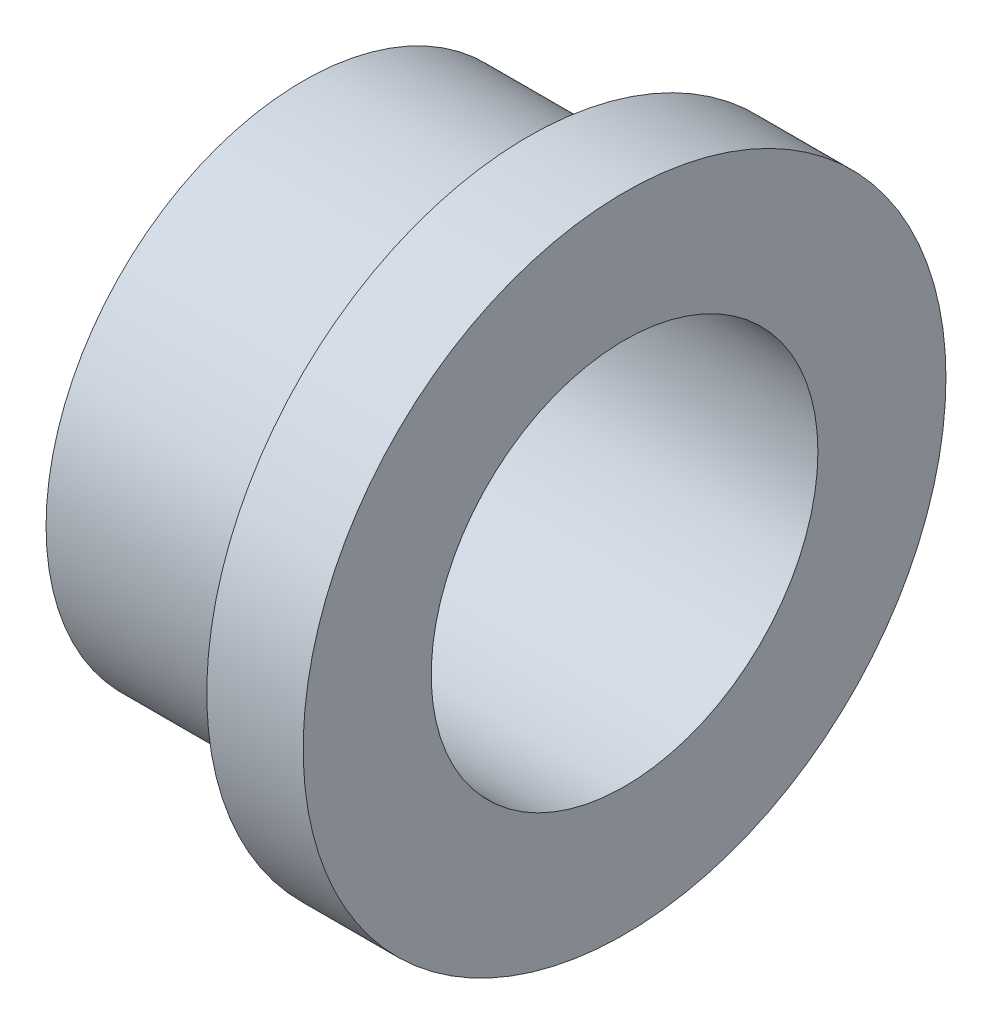
ISO-10303-21;
HEADER;
FILE_DESCRIPTION(('STEP AP214'),'2;1');
FILE_NAME('part.step','',(''),(''),'','','');
FILE_SCHEMA(('AUTOMOTIVE_DESIGN { 1 0 10303 214 1 1 1 1 }'));
ENDSEC;
DATA;
#1=APPLICATION_CONTEXT('core data for automotive mechanical design processes');
#2=APPLICATION_PROTOCOL_DEFINITION('international standard','automotive_design',2000,#1);
#3=PRODUCT_CONTEXT('',#1,'mechanical');
#4=PRODUCT('Part','Part','',(#3));
#5=PRODUCT_RELATED_PRODUCT_CATEGORY('part','',(#4));
#6=PRODUCT_DEFINITION_FORMATION('','',#4);
#7=PRODUCT_DEFINITION_CONTEXT('part definition',#1,'design');
#8=PRODUCT_DEFINITION('design','',#6,#7);
#9=PRODUCT_DEFINITION_SHAPE('','',#8);
#10=(LENGTH_UNIT() NAMED_UNIT(*) SI_UNIT(.MILLI.,.METRE.));
#11=(NAMED_UNIT(*) PLANE_ANGLE_UNIT() SI_UNIT($,.RADIAN.));
#12=(NAMED_UNIT(*) SI_UNIT($,.STERADIAN.) SOLID_ANGLE_UNIT());
#13=UNCERTAINTY_MEASURE_WITH_UNIT(LENGTH_MEASURE(1.E-05),#10,'distance_accuracy_value','');
#14=(GEOMETRIC_REPRESENTATION_CONTEXT(3) GLOBAL_UNCERTAINTY_ASSIGNED_CONTEXT((#13)) GLOBAL_UNIT_ASSIGNED_CONTEXT((#10,
#11,#12)) REPRESENTATION_CONTEXT('',''));
#15=CARTESIAN_POINT('',(0.,0.,0.));
#16=DIRECTION('',(0.,0.,1.));
#17=DIRECTION('',(1.,0.,0.));
#18=AXIS2_PLACEMENT_3D('',#15,#16,#17);
#19=CARTESIAN_POINT('',(-15.875,0.,0.));
#20=DIRECTION('',(1.,0.,0.));
#21=DIRECTION('',(0.,0.,-1.));
#22=AXIS2_PLACEMENT_3D('',#19,#20,#21);
#23=CYLINDRICAL_SURFACE('',#22,12.7);
#24=CARTESIAN_POINT('',(-15.875,0.,0.));
#25=DIRECTION('',(1.,0.,0.));
#26=DIRECTION('',(0.,0.,-1.));
#27=AXIS2_PLACEMENT_3D('',#24,#25,#26);
#28=CIRCLE('',#27,12.7);
#29=CARTESIAN_POINT('',(-15.875,0.,-12.7));
#30=VERTEX_POINT('',#29);
#31=EDGE_CURVE('E10',#30,#30,#28,.T.);
#32=ORIENTED_EDGE('',*,*,#31,.T.);
#33=EDGE_LOOP('',(#32));
#34=FACE_BOUND('',#33,.T.);
#35=CARTESIAN_POINT('',(-4.7625,0.,0.));
#36=DIRECTION('',(1.,0.,0.));
#37=DIRECTION('',(0.,0.,-1.));
#38=AXIS2_PLACEMENT_3D('',#35,#36,#37);
#39=CIRCLE('',#38,12.7);
#40=CARTESIAN_POINT('',(-4.7625,0.,-12.7));
#41=VERTEX_POINT('',#40);
#42=EDGE_CURVE('E45',#41,#41,#39,.F.);
#43=ORIENTED_EDGE('',*,*,#42,.T.);
#44=EDGE_LOOP('',(#43));
#45=FACE_BOUND('',#44,.T.);
#46=ADVANCED_FACE('F30',(#34,#45),#23,.T.);
#47=CARTESIAN_POINT('',(-15.875,0.,0.));
#48=DIRECTION('',(1.,0.,0.));
#49=DIRECTION('',(0.,0.,-1.));
#50=AXIS2_PLACEMENT_3D('',#47,#48,#49);
#51=PLANE('',#50);
#52=CARTESIAN_POINT('',(-15.875,0.,0.));
#53=DIRECTION('',(1.,0.,0.));
#54=DIRECTION('',(0.,0.,-1.));
#55=AXIS2_PLACEMENT_3D('',#52,#53,#54);
#56=CIRCLE('',#55,9.5504);
#57=CARTESIAN_POINT('',(-15.875,0.,-9.5504));
#58=VERTEX_POINT('',#57);
#59=EDGE_CURVE('E36',#58,#58,#56,.T.);
#60=ORIENTED_EDGE('',*,*,#59,.T.);
#61=EDGE_LOOP('',(#60));
#62=FACE_BOUND('',#61,.T.);
#63=ORIENTED_EDGE('',*,*,#31,.F.);
#64=EDGE_LOOP('',(#63));
#65=FACE_BOUND('',#64,.T.);
#66=ADVANCED_FACE('F70',(#62,#65),#51,.F.);
#67=CARTESIAN_POINT('',(0.,0.,0.));
#68=DIRECTION('',(1.,0.,0.));
#69=DIRECTION('',(0.,0.,-1.));
#70=AXIS2_PLACEMENT_3D('',#67,#68,#69);
#71=PLANE('',#70);
#72=CARTESIAN_POINT('',(0.,0.,0.));
#73=DIRECTION('',(1.,0.,0.));
#74=DIRECTION('',(0.,0.,-1.));
#75=AXIS2_PLACEMENT_3D('',#72,#73,#74);
#76=CIRCLE('',#75,9.5504);
#77=CARTESIAN_POINT('',(0.,0.,-9.5504));
#78=VERTEX_POINT('',#77);
#79=EDGE_CURVE('E40',#78,#78,#76,.T.);
#80=ORIENTED_EDGE('',*,*,#79,.F.);
#81=EDGE_LOOP('',(#80));
#82=FACE_BOUND('',#81,.T.);
#83=CARTESIAN_POINT('',(0.,0.,0.));
#84=DIRECTION('',(1.,0.,0.));
#85=DIRECTION('',(0.,0.,-1.));
#86=AXIS2_PLACEMENT_3D('',#83,#84,#85);
#87=CIRCLE('',#86,15.875);
#88=CARTESIAN_POINT('',(0.,0.,-15.875));
#89=VERTEX_POINT('',#88);
#90=EDGE_CURVE('E50',#89,#89,#87,.T.);
#91=ORIENTED_EDGE('',*,*,#90,.T.);
#92=EDGE_LOOP('',(#91));
#93=FACE_BOUND('',#92,.T.);
#94=ADVANCED_FACE('F74',(#82,#93),#71,.T.);
#95=CARTESIAN_POINT('',(-15.875,0.,0.));
#96=DIRECTION('',(1.,0.,0.));
#97=DIRECTION('',(0.,0.,-1.));
#98=AXIS2_PLACEMENT_3D('',#95,#96,#97);
#99=CYLINDRICAL_SURFACE('',#98,9.5504);
#100=ORIENTED_EDGE('',*,*,#79,.T.);
#101=EDGE_LOOP('',(#100));
#102=FACE_BOUND('',#101,.T.);
#103=ORIENTED_EDGE('',*,*,#59,.F.);
#104=EDGE_LOOP('',(#103));
#105=FACE_BOUND('',#104,.T.);
#106=ADVANCED_FACE('F66',(#102,#105),#99,.F.);
#107=CARTESIAN_POINT('',(-4.7625,0.,0.));
#108=DIRECTION('',(1.,0.,0.));
#109=DIRECTION('',(0.,0.,-1.));
#110=AXIS2_PLACEMENT_3D('',#107,#108,#109);
#111=CYLINDRICAL_SURFACE('',#110,15.875);
#112=CARTESIAN_POINT('',(-4.7625,0.,0.));
#113=DIRECTION('',(1.,0.,0.));
#114=DIRECTION('',(0.,0.,-1.));
#115=AXIS2_PLACEMENT_3D('',#112,#113,#114);
#116=CIRCLE('',#115,15.875);
#117=CARTESIAN_POINT('',(-4.7625,0.,-15.875));
#118=VERTEX_POINT('',#117);
#119=EDGE_CURVE('E49',#118,#118,#116,.T.);
#120=ORIENTED_EDGE('',*,*,#119,.T.);
#121=EDGE_LOOP('',(#120));
#122=FACE_BOUND('',#121,.T.);
#123=ORIENTED_EDGE('',*,*,#90,.F.);
#124=EDGE_LOOP('',(#123));
#125=FACE_BOUND('',#124,.T.);
#126=ADVANCED_FACE('F56',(#122,#125),#111,.T.);
#127=CARTESIAN_POINT('',(-4.7625,0.,0.));
#128=DIRECTION('',(1.,0.,0.));
#129=DIRECTION('',(0.,0.,-1.));
#130=AXIS2_PLACEMENT_3D('',#127,#128,#129);
#131=PLANE('',#130);
#132=ORIENTED_EDGE('',*,*,#42,.F.);
#133=EDGE_LOOP('',(#132));
#134=FACE_BOUND('',#133,.T.);
#135=ORIENTED_EDGE('',*,*,#119,.F.);
#136=EDGE_LOOP('',(#135));
#137=FACE_BOUND('',#136,.T.);
#138=ADVANCED_FACE('F59',(#134,#137),#131,.F.);
#139=CLOSED_SHELL('',(#46,#66,#94,#106,#126,#138));
#140=MANIFOLD_SOLID_BREP('B2',#139);
#141=ADVANCED_BREP_SHAPE_REPRESENTATION('',(#18,#140),#14);
#142=SHAPE_DEFINITION_REPRESENTATION(#9,#141);
ENDSEC;
END-ISO-10303-21;
